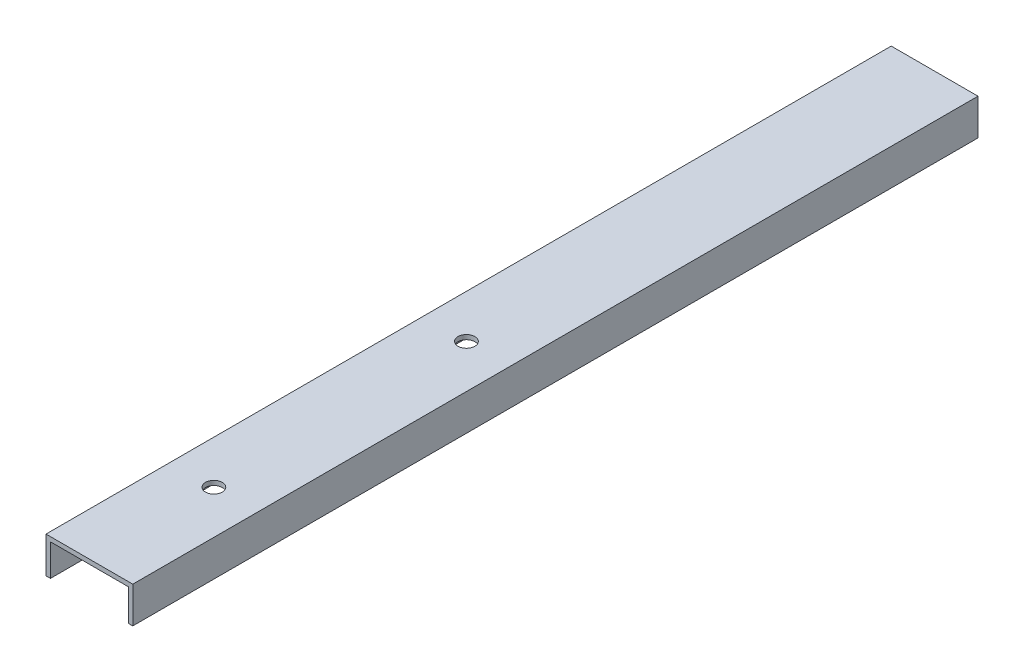
ISO-10303-21;
HEADER;
FILE_DESCRIPTION(('STEP AP214'),'2;1');
FILE_NAME('part.step','',(''),(''),'','','');
FILE_SCHEMA(('AUTOMOTIVE_DESIGN { 1 0 10303 214 1 1 1 1 }'));
ENDSEC;
DATA;
#1=APPLICATION_CONTEXT('core data for automotive mechanical design processes');
#2=APPLICATION_PROTOCOL_DEFINITION('international standard','automotive_design',2000,#1);
#3=PRODUCT_CONTEXT('',#1,'mechanical');
#4=PRODUCT('Part','Part','',(#3));
#5=PRODUCT_RELATED_PRODUCT_CATEGORY('part','',(#4));
#6=PRODUCT_DEFINITION_FORMATION('','',#4);
#7=PRODUCT_DEFINITION_CONTEXT('part definition',#1,'design');
#8=PRODUCT_DEFINITION('design','',#6,#7);
#9=PRODUCT_DEFINITION_SHAPE('','',#8);
#10=(LENGTH_UNIT() NAMED_UNIT(*) SI_UNIT(.MILLI.,.METRE.));
#11=(NAMED_UNIT(*) PLANE_ANGLE_UNIT() SI_UNIT($,.RADIAN.));
#12=(NAMED_UNIT(*) SI_UNIT($,.STERADIAN.) SOLID_ANGLE_UNIT());
#13=UNCERTAINTY_MEASURE_WITH_UNIT(LENGTH_MEASURE(1.E-05),#10,'distance_accuracy_value','');
#14=(GEOMETRIC_REPRESENTATION_CONTEXT(3) GLOBAL_UNCERTAINTY_ASSIGNED_CONTEXT((#13)) GLOBAL_UNIT_ASSIGNED_CONTEXT((#10,
#11,#12)) REPRESENTATION_CONTEXT('',''));
#15=CARTESIAN_POINT('',(0.,0.,0.));
#16=DIRECTION('',(0.,0.,1.));
#17=DIRECTION('',(1.,0.,0.));
#18=AXIS2_PLACEMENT_3D('',#15,#16,#17);
#19=CARTESIAN_POINT('',(1.27,0.,239.7125));
#20=DIRECTION('',(0.,1.,0.));
#21=DIRECTION('',(-1.,0.,0.));
#22=AXIS2_PLACEMENT_3D('',#19,#20,#21);
#23=PLANE('',#22);
#24=DIRECTION('',(1.,0.,0.));
#25=VECTOR('',#24,1.);
#26=CARTESIAN_POINT('',(1.27,0.,0.));
#27=LINE('',#26,#25);
#28=CARTESIAN_POINT('',(0.,0.,0.));
#29=VERTEX_POINT('',#28);
#30=CARTESIAN_POINT('',(1.27,0.,0.));
#31=VERTEX_POINT('',#30);
#32=EDGE_CURVE('E132',#29,#31,#27,.T.);
#33=ORIENTED_EDGE('',*,*,#32,.T.);
#34=DIRECTION('',(0.,0.,-1.));
#35=VECTOR('',#34,1.);
#36=CARTESIAN_POINT('',(1.27,0.,239.7125));
#37=LINE('',#36,#35);
#38=CARTESIAN_POINT('',(1.27,0.,239.7125));
#39=VERTEX_POINT('',#38);
#40=EDGE_CURVE('E11',#39,#31,#37,.T.);
#41=ORIENTED_EDGE('',*,*,#40,.F.);
#42=DIRECTION('',(1.,0.,0.));
#43=VECTOR('',#42,1.);
#44=CARTESIAN_POINT('',(1.27,0.,239.7125));
#45=LINE('',#44,#43);
#46=CARTESIAN_POINT('',(0.,0.,239.7125));
#47=VERTEX_POINT('',#46);
#48=EDGE_CURVE('E147',#47,#39,#45,.T.);
#49=ORIENTED_EDGE('',*,*,#48,.F.);
#50=DIRECTION('',(0.,0.,-1.));
#51=VECTOR('',#50,1.);
#52=CARTESIAN_POINT('',(0.,0.,239.7125));
#53=LINE('',#52,#51);
#54=EDGE_CURVE('E128',#47,#29,#53,.T.);
#55=ORIENTED_EDGE('',*,*,#54,.T.);
#56=EDGE_LOOP('',(#33,#41,#49,#55));
#57=FACE_BOUND('',#56,.T.);
#58=ADVANCED_FACE('F36',(#57),#23,.F.);
#59=CARTESIAN_POINT('',(1.27,8.9916,239.7125));
#60=DIRECTION('',(-1.,0.,0.));
#61=DIRECTION('',(0.,0.,1.));
#62=AXIS2_PLACEMENT_3D('',#59,#60,#61);
#63=PLANE('',#62);
#64=DIRECTION('',(0.,1.,0.));
#65=VECTOR('',#64,1.);
#66=CARTESIAN_POINT('',(1.27,8.9916,0.));
#67=LINE('',#66,#65);
#68=CARTESIAN_POINT('',(1.27,8.9916,0.));
#69=VERTEX_POINT('',#68);
#70=EDGE_CURVE('E135',#31,#69,#67,.T.);
#71=ORIENTED_EDGE('',*,*,#70,.T.);
#72=DIRECTION('',(0.,0.,-1.));
#73=VECTOR('',#72,1.);
#74=CARTESIAN_POINT('',(1.27,8.9916,239.7125));
#75=LINE('',#74,#73);
#76=CARTESIAN_POINT('',(1.27,8.9916,239.7125));
#77=VERTEX_POINT('',#76);
#78=EDGE_CURVE('E44',#77,#69,#75,.T.);
#79=ORIENTED_EDGE('',*,*,#78,.F.);
#80=DIRECTION('',(0.,1.,0.));
#81=VECTOR('',#80,1.);
#82=CARTESIAN_POINT('',(1.27,8.9916,239.7125));
#83=LINE('',#82,#81);
#84=EDGE_CURVE('E95',#39,#77,#83,.T.);
#85=ORIENTED_EDGE('',*,*,#84,.F.);
#86=ORIENTED_EDGE('',*,*,#40,.T.);
#87=EDGE_LOOP('',(#71,#79,#85,#86));
#88=FACE_BOUND('',#87,.T.);
#89=ADVANCED_FACE('F208',(#88),#63,.F.);
#90=CARTESIAN_POINT('',(23.3426,8.9916,239.7125));
#91=DIRECTION('',(0.,1.,0.));
#92=DIRECTION('',(-1.,0.,0.));
#93=AXIS2_PLACEMENT_3D('',#90,#91,#92);
#94=PLANE('',#93);
#95=CARTESIAN_POINT('',(12.3063,8.9916,132.7785));
#96=DIRECTION('',(0.,1.,0.));
#97=DIRECTION('',(-1.,0.,0.));
#98=AXIS2_PLACEMENT_3D('',#95,#96,#97);
#99=CIRCLE('',#98,2.38760000000001);
#100=CARTESIAN_POINT('',(9.91869999999998,8.9916,132.7785));
#101=VERTEX_POINT('',#100);
#102=EDGE_CURVE('E185',#101,#101,#99,.T.);
#103=ORIENTED_EDGE('',*,*,#102,.T.);
#104=EDGE_LOOP('',(#103));
#105=FACE_BOUND('',#104,.T.);
#106=CARTESIAN_POINT('',(12.3063,8.9916,204.4065));
#107=DIRECTION('',(0.,1.,0.));
#108=DIRECTION('',(-1.,0.,0.));
#109=AXIS2_PLACEMENT_3D('',#106,#107,#108);
#110=CIRCLE('',#109,2.38760000000001);
#111=CARTESIAN_POINT('',(9.91869999999999,8.9916,204.4065));
#112=VERTEX_POINT('',#111);
#113=EDGE_CURVE('E136',#112,#112,#110,.T.);
#114=ORIENTED_EDGE('',*,*,#113,.T.);
#115=EDGE_LOOP('',(#114));
#116=FACE_BOUND('',#115,.T.);
#117=DIRECTION('',(1.,0.,0.));
#118=VECTOR('',#117,1.);
#119=CARTESIAN_POINT('',(23.3426,8.9916,0.));
#120=LINE('',#119,#118);
#121=CARTESIAN_POINT('',(23.3426,8.9916,0.));
#122=VERTEX_POINT('',#121);
#123=EDGE_CURVE('E138',#69,#122,#120,.T.);
#124=ORIENTED_EDGE('',*,*,#123,.T.);
#125=DIRECTION('',(0.,0.,-1.));
#126=VECTOR('',#125,1.);
#127=CARTESIAN_POINT('',(23.3426,8.9916,239.7125));
#128=LINE('',#127,#126);
#129=CARTESIAN_POINT('',(23.3426,8.9916,239.7125));
#130=VERTEX_POINT('',#129);
#131=EDGE_CURVE('E154',#130,#122,#128,.T.);
#132=ORIENTED_EDGE('',*,*,#131,.F.);
#133=DIRECTION('',(1.,0.,0.));
#134=VECTOR('',#133,1.);
#135=CARTESIAN_POINT('',(23.3426,8.9916,239.7125));
#136=LINE('',#135,#134);
#137=EDGE_CURVE('E162',#77,#130,#136,.T.);
#138=ORIENTED_EDGE('',*,*,#137,.F.);
#139=ORIENTED_EDGE('',*,*,#78,.T.);
#140=EDGE_LOOP('',(#124,#132,#138,#139));
#141=FACE_BOUND('',#140,.T.);
#142=ADVANCED_FACE('F160',(#105,#116,#141),#94,.F.);
#143=CARTESIAN_POINT('',(23.3426,0.,239.7125));
#144=DIRECTION('',(1.,0.,0.));
#145=DIRECTION('',(0.,1.,0.));
#146=AXIS2_PLACEMENT_3D('',#143,#144,#145);
#147=PLANE('',#146);
#148=DIRECTION('',(0.,-1.,0.));
#149=VECTOR('',#148,1.);
#150=CARTESIAN_POINT('',(23.3426,0.,0.));
#151=LINE('',#150,#149);
#152=CARTESIAN_POINT('',(23.3426,0.,0.));
#153=VERTEX_POINT('',#152);
#154=EDGE_CURVE('E140',#122,#153,#151,.T.);
#155=ORIENTED_EDGE('',*,*,#154,.T.);
#156=DIRECTION('',(0.,0.,-1.));
#157=VECTOR('',#156,1.);
#158=CARTESIAN_POINT('',(23.3426,0.,239.7125));
#159=LINE('',#158,#157);
#160=CARTESIAN_POINT('',(23.3426,0.,239.7125));
#161=VERTEX_POINT('',#160);
#162=EDGE_CURVE('E151',#161,#153,#159,.T.);
#163=ORIENTED_EDGE('',*,*,#162,.F.);
#164=DIRECTION('',(0.,-1.,0.));
#165=VECTOR('',#164,1.);
#166=CARTESIAN_POINT('',(23.3426,0.,239.7125));
#167=LINE('',#166,#165);
#168=EDGE_CURVE('E174',#130,#161,#167,.T.);
#169=ORIENTED_EDGE('',*,*,#168,.F.);
#170=ORIENTED_EDGE('',*,*,#131,.T.);
#171=EDGE_LOOP('',(#155,#163,#169,#170));
#172=FACE_BOUND('',#171,.T.);
#173=ADVANCED_FACE('F170',(#172),#147,.F.);
#174=CARTESIAN_POINT('',(24.6126,0.,239.7125));
#175=DIRECTION('',(0.,1.,0.));
#176=DIRECTION('',(-1.,0.,0.));
#177=AXIS2_PLACEMENT_3D('',#174,#175,#176);
#178=PLANE('',#177);
#179=DIRECTION('',(1.,0.,0.));
#180=VECTOR('',#179,1.);
#181=CARTESIAN_POINT('',(24.6126,0.,0.));
#182=LINE('',#181,#180);
#183=CARTESIAN_POINT('',(24.6126,0.,0.));
#184=VERTEX_POINT('',#183);
#185=EDGE_CURVE('E142',#153,#184,#182,.T.);
#186=ORIENTED_EDGE('',*,*,#185,.T.);
#187=DIRECTION('',(0.,0.,-1.));
#188=VECTOR('',#187,1.);
#189=CARTESIAN_POINT('',(24.6126,0.,239.7125));
#190=LINE('',#189,#188);
#191=CARTESIAN_POINT('',(24.6126,0.,239.7125));
#192=VERTEX_POINT('',#191);
#193=EDGE_CURVE('E123',#192,#184,#190,.T.);
#194=ORIENTED_EDGE('',*,*,#193,.F.);
#195=DIRECTION('',(1.,0.,0.));
#196=VECTOR('',#195,1.);
#197=CARTESIAN_POINT('',(24.6126,0.,239.7125));
#198=LINE('',#197,#196);
#199=EDGE_CURVE('E114',#161,#192,#198,.T.);
#200=ORIENTED_EDGE('',*,*,#199,.F.);
#201=ORIENTED_EDGE('',*,*,#162,.T.);
#202=EDGE_LOOP('',(#186,#194,#200,#201));
#203=FACE_BOUND('',#202,.T.);
#204=ADVANCED_FACE('F173',(#203),#178,.F.);
#205=CARTESIAN_POINT('',(24.6126,10.2616,239.7125));
#206=DIRECTION('',(-1.,0.,0.));
#207=DIRECTION('',(0.,-1.,0.));
#208=AXIS2_PLACEMENT_3D('',#205,#206,#207);
#209=PLANE('',#208);
#210=DIRECTION('',(0.,1.,0.));
#211=VECTOR('',#210,1.);
#212=CARTESIAN_POINT('',(24.6126,10.2616,0.));
#213=LINE('',#212,#211);
#214=CARTESIAN_POINT('',(24.6126,10.2616,0.));
#215=VERTEX_POINT('',#214);
#216=EDGE_CURVE('E122',#184,#215,#213,.T.);
#217=ORIENTED_EDGE('',*,*,#216,.T.);
#218=DIRECTION('',(0.,0.,-1.));
#219=VECTOR('',#218,1.);
#220=CARTESIAN_POINT('',(24.6126,10.2616,239.7125));
#221=LINE('',#220,#219);
#222=CARTESIAN_POINT('',(24.6126,10.2616,239.7125));
#223=VERTEX_POINT('',#222);
#224=EDGE_CURVE('E119',#223,#215,#221,.T.);
#225=ORIENTED_EDGE('',*,*,#224,.F.);
#226=DIRECTION('',(0.,1.,0.));
#227=VECTOR('',#226,1.);
#228=CARTESIAN_POINT('',(24.6126,10.2616,239.7125));
#229=LINE('',#228,#227);
#230=EDGE_CURVE('E108',#192,#223,#229,.T.);
#231=ORIENTED_EDGE('',*,*,#230,.F.);
#232=ORIENTED_EDGE('',*,*,#193,.T.);
#233=EDGE_LOOP('',(#217,#225,#231,#232));
#234=FACE_BOUND('',#233,.T.);
#235=ADVANCED_FACE('F120',(#234),#209,.F.);
#236=CARTESIAN_POINT('',(0.,10.2616,239.7125));
#237=DIRECTION('',(0.,-1.,0.));
#238=DIRECTION('',(1.,0.,0.));
#239=AXIS2_PLACEMENT_3D('',#236,#237,#238);
#240=PLANE('',#239);
#241=CARTESIAN_POINT('',(12.3063,10.2616,132.7785));
#242=DIRECTION('',(0.,1.,0.));
#243=DIRECTION('',(0.,0.,1.));
#244=AXIS2_PLACEMENT_3D('',#241,#242,#243);
#245=CIRCLE('',#244,2.38760000000001);
#246=CARTESIAN_POINT('',(12.3063,10.2616,135.1661));
#247=VERTEX_POINT('',#246);
#248=EDGE_CURVE('E188',#247,#247,#245,.T.);
#249=ORIENTED_EDGE('',*,*,#248,.F.);
#250=EDGE_LOOP('',(#249));
#251=FACE_BOUND('',#250,.T.);
#252=CARTESIAN_POINT('',(12.3063,10.2616,204.4065));
#253=DIRECTION('',(0.,1.,0.));
#254=DIRECTION('',(0.,0.,1.));
#255=AXIS2_PLACEMENT_3D('',#252,#253,#254);
#256=CIRCLE('',#255,2.38760000000001);
#257=CARTESIAN_POINT('',(12.3063,10.2616,206.7941));
#258=VERTEX_POINT('',#257);
#259=EDGE_CURVE('E182',#258,#258,#256,.T.);
#260=ORIENTED_EDGE('',*,*,#259,.F.);
#261=EDGE_LOOP('',(#260));
#262=FACE_BOUND('',#261,.T.);
#263=DIRECTION('',(-1.,0.,0.));
#264=VECTOR('',#263,1.);
#265=CARTESIAN_POINT('',(0.,10.2616,0.));
#266=LINE('',#265,#264);
#267=CARTESIAN_POINT('',(0.,10.2616,0.));
#268=VERTEX_POINT('',#267);
#269=EDGE_CURVE('E81',#215,#268,#266,.T.);
#270=ORIENTED_EDGE('',*,*,#269,.T.);
#271=DIRECTION('',(0.,0.,-1.));
#272=VECTOR('',#271,1.);
#273=CARTESIAN_POINT('',(0.,10.2616,239.7125));
#274=LINE('',#273,#272);
#275=CARTESIAN_POINT('',(0.,10.2616,239.7125));
#276=VERTEX_POINT('',#275);
#277=EDGE_CURVE('E124',#276,#268,#274,.T.);
#278=ORIENTED_EDGE('',*,*,#277,.F.);
#279=DIRECTION('',(-1.,0.,0.));
#280=VECTOR('',#279,1.);
#281=CARTESIAN_POINT('',(0.,10.2616,239.7125));
#282=LINE('',#281,#280);
#283=EDGE_CURVE('E112',#223,#276,#282,.T.);
#284=ORIENTED_EDGE('',*,*,#283,.F.);
#285=ORIENTED_EDGE('',*,*,#224,.T.);
#286=EDGE_LOOP('',(#270,#278,#284,#285));
#287=FACE_BOUND('',#286,.T.);
#288=ADVANCED_FACE('F126',(#251,#262,#287),#240,.F.);
#289=CARTESIAN_POINT('',(0.,0.,239.7125));
#290=DIRECTION('',(1.,0.,0.));
#291=DIRECTION('',(0.,1.,0.));
#292=AXIS2_PLACEMENT_3D('',#289,#290,#291);
#293=PLANE('',#292);
#294=DIRECTION('',(0.,-1.,0.));
#295=VECTOR('',#294,1.);
#296=CARTESIAN_POINT('',(0.,0.,0.));
#297=LINE('',#296,#295);
#298=EDGE_CURVE('E87',#268,#29,#297,.T.);
#299=ORIENTED_EDGE('',*,*,#298,.T.);
#300=ORIENTED_EDGE('',*,*,#54,.F.);
#301=DIRECTION('',(0.,-1.,0.));
#302=VECTOR('',#301,1.);
#303=CARTESIAN_POINT('',(0.,0.,239.7125));
#304=LINE('',#303,#302);
#305=EDGE_CURVE('E52',#276,#47,#304,.T.);
#306=ORIENTED_EDGE('',*,*,#305,.F.);
#307=ORIENTED_EDGE('',*,*,#277,.T.);
#308=EDGE_LOOP('',(#299,#300,#306,#307));
#309=FACE_BOUND('',#308,.T.);
#310=ADVANCED_FACE('F197',(#309),#293,.F.);
#311=CARTESIAN_POINT('',(0.,0.,239.7125));
#312=DIRECTION('',(0.,0.,-1.));
#313=DIRECTION('',(-1.,0.,0.));
#314=AXIS2_PLACEMENT_3D('',#311,#312,#313);
#315=PLANE('',#314);
#316=ORIENTED_EDGE('',*,*,#48,.T.);
#317=ORIENTED_EDGE('',*,*,#84,.T.);
#318=ORIENTED_EDGE('',*,*,#137,.T.);
#319=ORIENTED_EDGE('',*,*,#168,.T.);
#320=ORIENTED_EDGE('',*,*,#199,.T.);
#321=ORIENTED_EDGE('',*,*,#230,.T.);
#322=ORIENTED_EDGE('',*,*,#283,.T.);
#323=ORIENTED_EDGE('',*,*,#305,.T.);
#324=EDGE_LOOP('',(#316,#317,#318,#319,#320,#321,#322,#323));
#325=FACE_BOUND('',#324,.T.);
#326=ADVANCED_FACE('F110',(#325),#315,.F.);
#327=CARTESIAN_POINT('',(0.,0.,0.));
#328=DIRECTION('',(0.,0.,-1.));
#329=DIRECTION('',(-1.,0.,0.));
#330=AXIS2_PLACEMENT_3D('',#327,#328,#329);
#331=PLANE('',#330);
#332=ORIENTED_EDGE('',*,*,#32,.F.);
#333=ORIENTED_EDGE('',*,*,#298,.F.);
#334=ORIENTED_EDGE('',*,*,#269,.F.);
#335=ORIENTED_EDGE('',*,*,#216,.F.);
#336=ORIENTED_EDGE('',*,*,#185,.F.);
#337=ORIENTED_EDGE('',*,*,#154,.F.);
#338=ORIENTED_EDGE('',*,*,#123,.F.);
#339=ORIENTED_EDGE('',*,*,#70,.F.);
#340=EDGE_LOOP('',(#332,#333,#334,#335,#336,#337,#338,#339));
#341=FACE_BOUND('',#340,.T.);
#342=ADVANCED_FACE('F166',(#341),#331,.T.);
#343=CARTESIAN_POINT('',(12.3063,0.,204.4065));
#344=DIRECTION('',(0.,1.,0.));
#345=DIRECTION('',(0.,0.,1.));
#346=AXIS2_PLACEMENT_3D('',#343,#344,#345);
#347=CYLINDRICAL_SURFACE('',#346,2.38760000000001);
#348=ORIENTED_EDGE('',*,*,#259,.T.);
#349=EDGE_LOOP('',(#348));
#350=FACE_BOUND('',#349,.T.);
#351=ORIENTED_EDGE('',*,*,#113,.F.);
#352=EDGE_LOOP('',(#351));
#353=FACE_BOUND('',#352,.T.);
#354=ADVANCED_FACE('F201',(#350,#353),#347,.F.);
#355=CARTESIAN_POINT('',(12.3063,0.,132.7785));
#356=DIRECTION('',(0.,1.,0.));
#357=DIRECTION('',(0.,0.,1.));
#358=AXIS2_PLACEMENT_3D('',#355,#356,#357);
#359=CYLINDRICAL_SURFACE('',#358,2.38760000000001);
#360=ORIENTED_EDGE('',*,*,#248,.T.);
#361=EDGE_LOOP('',(#360));
#362=FACE_BOUND('',#361,.T.);
#363=ORIENTED_EDGE('',*,*,#102,.F.);
#364=EDGE_LOOP('',(#363));
#365=FACE_BOUND('',#364,.T.);
#366=ADVANCED_FACE('F192',(#362,#365),#359,.F.);
#367=CLOSED_SHELL('',(#58,#89,#142,#173,#204,#235,#288,#310,#326,#342,#354,#366));
#368=MANIFOLD_SOLID_BREP('B2',#367);
#369=ADVANCED_BREP_SHAPE_REPRESENTATION('',(#18,#368),#14);
#370=SHAPE_DEFINITION_REPRESENTATION(#9,#369);
ENDSEC;
END-ISO-10303-21;
